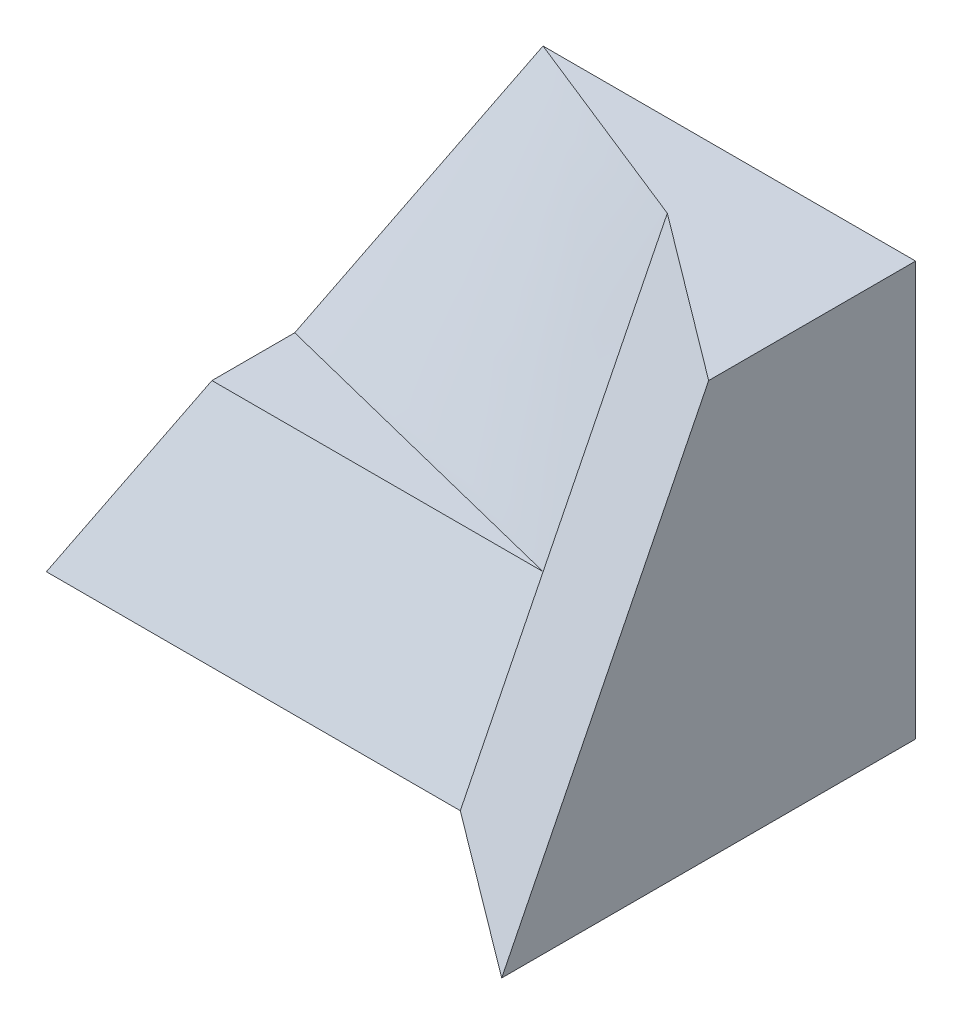
ISO-10303-21;
HEADER;
FILE_DESCRIPTION(('STEP AP214'),'2;1');
FILE_NAME('part.step','',(''),(''),'','','');
FILE_SCHEMA(('AUTOMOTIVE_DESIGN { 1 0 10303 214 1 1 1 1 }'));
ENDSEC;
DATA;
#1=APPLICATION_CONTEXT('core data for automotive mechanical design processes');
#2=APPLICATION_PROTOCOL_DEFINITION('international standard','automotive_design',2000,#1);
#3=PRODUCT_CONTEXT('',#1,'mechanical');
#4=PRODUCT('Part','Part','',(#3));
#5=PRODUCT_RELATED_PRODUCT_CATEGORY('part','',(#4));
#6=PRODUCT_DEFINITION_FORMATION('','',#4);
#7=PRODUCT_DEFINITION_CONTEXT('part definition',#1,'design');
#8=PRODUCT_DEFINITION('design','',#6,#7);
#9=PRODUCT_DEFINITION_SHAPE('','',#8);
#10=(LENGTH_UNIT() NAMED_UNIT(*) SI_UNIT(.MILLI.,.METRE.));
#11=(NAMED_UNIT(*) PLANE_ANGLE_UNIT() SI_UNIT($,.RADIAN.));
#12=(NAMED_UNIT(*) SI_UNIT($,.STERADIAN.) SOLID_ANGLE_UNIT());
#13=UNCERTAINTY_MEASURE_WITH_UNIT(LENGTH_MEASURE(1.E-05),#10,'distance_accuracy_value','');
#14=(GEOMETRIC_REPRESENTATION_CONTEXT(3) GLOBAL_UNCERTAINTY_ASSIGNED_CONTEXT((#13)) GLOBAL_UNIT_ASSIGNED_CONTEXT((#10,
#11,#12)) REPRESENTATION_CONTEXT('',''));
#15=CARTESIAN_POINT('',(0.,0.,0.));
#16=DIRECTION('',(0.,0.,1.));
#17=DIRECTION('',(1.,0.,0.));
#18=AXIS2_PLACEMENT_3D('',#15,#16,#17);
#19=CARTESIAN_POINT('',(-3.5,2.5,1.));
#20=DIRECTION('',(0.,-0.447213595499958,-0.894427190999916));
#21=DIRECTION('',(0.,0.894427190999916,-0.447213595499958));
#22=AXIS2_PLACEMENT_3D('',#19,#20,#21);
#23=PLANE('',#22);
#24=DIRECTION('',(1.,0.,0.));
#25=VECTOR('',#24,1.);
#26=CARTESIAN_POINT('',(-3.5,-0.500000000000001,2.5));
#27=LINE('',#26,#25);
#28=CARTESIAN_POINT('',(-2.5,-0.500000000000001,2.5));
#29=VERTEX_POINT('',#28);
#30=CARTESIAN_POINT('',(1.49999999499081,-0.49949843516576,2.49974923855887));
#31=VERTEX_POINT('',#30);
#32=EDGE_CURVE('E12',#29,#31,#27,.T.);
#33=ORIENTED_EDGE('',*,*,#32,.F.);
#34=DIRECTION('',(-0.408248290463863,-0.816496580927726,0.408248290463863));
#35=VECTOR('',#34,1.);
#36=CARTESIAN_POINT('',(-2.33333333333334,-0.166666666666667,2.33333333333333));
#37=LINE('',#36,#35);
#38=CARTESIAN_POINT('',(-3.5,-2.5,3.5));
#39=VERTEX_POINT('',#38);
#40=EDGE_CURVE('E120',#29,#39,#37,.T.);
#41=ORIENTED_EDGE('',*,*,#40,.T.);
#42=DIRECTION('',(1.,0.,0.));
#43=VECTOR('',#42,1.);
#44=CARTESIAN_POINT('',(-3.5,-2.5,3.5));
#45=LINE('',#44,#43);
#46=CARTESIAN_POINT('',(1.5,-2.5,3.5));
#47=VERTEX_POINT('',#46);
#48=EDGE_CURVE('E115',#39,#47,#45,.T.);
#49=ORIENTED_EDGE('',*,*,#48,.T.);
#50=DIRECTION('',(0.,0.894427190999916,-0.447213595499958));
#51=VECTOR('',#50,1.);
#52=CARTESIAN_POINT('',(1.5,-2.5,3.5));
#53=LINE('',#52,#51);
#54=EDGE_CURVE('E180',#47,#31,#53,.T.);
#55=ORIENTED_EDGE('',*,*,#54,.T.);
#56=EDGE_LOOP('',(#33,#41,#49,#55));
#57=FACE_BOUND('',#56,.T.);
#58=ADVANCED_FACE('F36',(#57),#23,.F.);
#59=CARTESIAN_POINT('',(0.,-2.5,5.));
#60=DIRECTION('',(0.,-1.,0.));
#61=DIRECTION('',(1.,0.,0.));
#62=AXIS2_PLACEMENT_3D('',#59,#60,#61);
#63=PLANE('',#62);
#64=ORIENTED_EDGE('',*,*,#48,.F.);
#65=DIRECTION('',(0.,0.,-1.));
#66=VECTOR('',#65,1.);
#67=CARTESIAN_POINT('',(-3.5,-2.5,5.));
#68=LINE('',#67,#66);
#69=CARTESIAN_POINT('',(-3.5,-2.5,0.));
#70=VERTEX_POINT('',#69);
#71=EDGE_CURVE('E62',#39,#70,#68,.T.);
#72=ORIENTED_EDGE('',*,*,#71,.T.);
#73=DIRECTION('',(-1.,0.,0.));
#74=VECTOR('',#73,1.);
#75=CARTESIAN_POINT('',(0.,-2.5,0.));
#76=LINE('',#75,#74);
#77=CARTESIAN_POINT('',(3.5,-2.5,0.));
#78=VERTEX_POINT('',#77);
#79=EDGE_CURVE('E183',#78,#70,#76,.T.);
#80=ORIENTED_EDGE('',*,*,#79,.F.);
#81=DIRECTION('',(0.,0.,-1.));
#82=VECTOR('',#81,1.);
#83=CARTESIAN_POINT('',(3.5,-2.5,5.));
#84=LINE('',#83,#82);
#85=CARTESIAN_POINT('',(3.5,-2.5,5.));
#86=VERTEX_POINT('',#85);
#87=EDGE_CURVE('E47',#86,#78,#84,.T.);
#88=ORIENTED_EDGE('',*,*,#87,.F.);
#89=DIRECTION('',(-0.8,0.,-0.6));
#90=VECTOR('',#89,1.);
#91=CARTESIAN_POINT('',(3.5,-2.5,5.));
#92=LINE('',#91,#90);
#93=EDGE_CURVE('E174',#86,#47,#92,.T.);
#94=ORIENTED_EDGE('',*,*,#93,.T.);
#95=EDGE_LOOP('',(#64,#72,#80,#88,#94));
#96=FACE_BOUND('',#95,.T.);
#97=ADVANCED_FACE('F38',(#96),#63,.T.);
#98=CARTESIAN_POINT('',(3.5,0.,5.));
#99=DIRECTION('',(1.,0.,0.));
#100=DIRECTION('',(0.,1.,0.));
#101=AXIS2_PLACEMENT_3D('',#98,#99,#100);
#102=PLANE('',#101);
#103=DIRECTION('',(0.,0.,-1.));
#104=VECTOR('',#103,1.);
#105=CARTESIAN_POINT('',(3.5,2.5,5.));
#106=LINE('',#105,#104);
#107=CARTESIAN_POINT('',(3.5,2.5,2.5));
#108=VERTEX_POINT('',#107);
#109=CARTESIAN_POINT('',(3.5,2.5,0.));
#110=VERTEX_POINT('',#109);
#111=EDGE_CURVE('E201',#108,#110,#106,.T.);
#112=ORIENTED_EDGE('',*,*,#111,.F.);
#113=DIRECTION('',(0.,-0.894427190999916,0.447213595499958));
#114=VECTOR('',#113,1.);
#115=CARTESIAN_POINT('',(3.5,2.5,2.5));
#116=LINE('',#115,#114);
#117=EDGE_CURVE('E177',#108,#86,#116,.T.);
#118=ORIENTED_EDGE('',*,*,#117,.T.);
#119=ORIENTED_EDGE('',*,*,#87,.T.);
#120=DIRECTION('',(0.,-1.,0.));
#121=VECTOR('',#120,1.);
#122=CARTESIAN_POINT('',(3.5,0.,0.));
#123=LINE('',#122,#121);
#124=EDGE_CURVE('E196',#110,#78,#123,.T.);
#125=ORIENTED_EDGE('',*,*,#124,.F.);
#126=EDGE_LOOP('',(#112,#118,#119,#125));
#127=FACE_BOUND('',#126,.T.);
#128=ADVANCED_FACE('F239',(#127),#102,.T.);
#129=CARTESIAN_POINT('',(0.,2.5,5.));
#130=DIRECTION('',(0.,-1.,0.));
#131=DIRECTION('',(1.,0.,0.));
#132=AXIS2_PLACEMENT_3D('',#129,#130,#131);
#133=PLANE('',#132);
#134=DIRECTION('',(-1.,0.,0.));
#135=VECTOR('',#134,1.);
#136=CARTESIAN_POINT('',(0.,2.5,0.));
#137=LINE('',#136,#135);
#138=CARTESIAN_POINT('',(-1.00006375654728,2.50011954352615,0.000762430436338035));
#139=VERTEX_POINT('',#138);
#140=EDGE_CURVE('E199',#110,#139,#137,.T.);
#141=ORIENTED_EDGE('',*,*,#140,.T.);
#142=CARTESIAN_POINT('',(1.50021741228457,2.49959235196642,0.999293410075138));
#143=CARTESIAN_POINT('',(1.39588324561377,2.49988497110604,0.958129375331939));
#144=CARTESIAN_POINT('',(1.29161180404469,2.50008307623686,0.916806443358955));
#145=CARTESIAN_POINT('',(1.08314635242492,2.50033409658177,0.833908915649146));
#146=CARTESIAN_POINT('',(0.978952360359691,2.50038698481392,0.792334274581646));
#147=CARTESIAN_POINT('',(0.770618639280685,2.50039133358123,0.709009251750408));
#148=CARTESIAN_POINT('',(0.666478919361713,2.50034278058262,0.667258847278852));
#149=CARTESIAN_POINT('',(0.458228935684702,2.5001906695274,0.583662744287227));
#150=CARTESIAN_POINT('',(0.354118674646693,2.50008710743751,0.541817039003707));
#151=CARTESIAN_POINT('',(0.145900995845282,2.49987487584203,0.458116823310599));
#152=CARTESIAN_POINT('',(0.0417935781019091,2.49976620630677,0.416262312851274));
#153=CARTESIAN_POINT('',(-0.166447704056789,2.49959862650725,0.332639577978069));
#154=CARTESIAN_POINT('',(-0.270581566178799,2.49953971284328,0.290871347863409));
#155=CARTESIAN_POINT('',(-0.478907918440386,2.49953186287807,0.207525525693154));
#156=CARTESIAN_POINT('',(-0.583100397675124,2.49958291036673,0.165947906443845));
#157=CARTESIAN_POINT('',(-0.791581114386241,2.49986454004039,0.0831038588574716));
#158=CARTESIAN_POINT('',(-0.895869324555028,2.50009508121571,0.0418373616112312));
#159=CARTESIAN_POINT('',(-1.00024008118109,2.50045015221454,0.000780263838536825));
#160=B_SPLINE_CURVE_WITH_KNOTS('',3,(#142,#143,#144,#145,#146,#147,#148,#149,#150,#151,#152,
#153,#154,#155,#156,#157,#158,#159),.UNSPECIFIED.,.F.,.F.,(4,2,2,2,2,2,2,2,4),(0.,
0.336483664304154,0.673029844543172,1.00962092791999,1.34623669367658,1.68285441482449,
2.01944913374451,2.35599423642809,2.69246246975392),.UNSPECIFIED.);
#161=CARTESIAN_POINT('',(1.50020412974058,2.4998907316807,0.999405016011522));
#162=VERTEX_POINT('',#161);
#163=EDGE_CURVE('E105',#139,#162,#160,.F.);
#164=ORIENTED_EDGE('',*,*,#163,.T.);
#165=DIRECTION('',(0.8,0.,0.6));
#166=VECTOR('',#165,1.);
#167=CARTESIAN_POINT('',(1.5,2.5,1.));
#168=LINE('',#167,#166);
#169=EDGE_CURVE('E186',#162,#108,#168,.T.);
#170=ORIENTED_EDGE('',*,*,#169,.T.);
#171=ORIENTED_EDGE('',*,*,#111,.T.);
#172=EDGE_LOOP('',(#141,#164,#170,#171));
#173=FACE_BOUND('',#172,.T.);
#174=ADVANCED_FACE('F236',(#173),#133,.F.);
#175=CARTESIAN_POINT('',(-1.8,0.9,5.));
#176=DIRECTION('',(-0.894427190999916,0.447213595499958,0.));
#177=DIRECTION('',(-0.447213595499958,-0.894427190999916,0.));
#178=AXIS2_PLACEMENT_3D('',#175,#176,#177);
#179=PLANE('',#178);
#180=CARTESIAN_POINT('',(-1.00024008118109,2.50045015221454,0.000780263838536738));
#181=CARTESIAN_POINT('',(-1.06257985554123,2.37512753926243,0.0627466460640722));
#182=CARTESIAN_POINT('',(-1.12499615433921,2.24997446405537,0.124976861087853));
#183=CARTESIAN_POINT('',(-1.24992048781638,1.99984031634894,0.249735431547686));
#184=CARTESIAN_POINT('',(-1.31242853256175,1.87485926617812,0.31226382170463));
#185=CARTESIAN_POINT('',(-1.43746211946966,1.62492796408178,0.437376301868997));
#186=CARTESIAN_POINT('',(-1.49998766212768,1.49997771326859,0.499960393593188));
#187=CARTESIAN_POINT('',(-1.6250227483665,1.25004563029584,0.62507566083486));
#188=CARTESIAN_POINT('',(-1.68753229218433,1.12506379866605,0.68760683717223));
#189=CARTESIAN_POINT('',(-1.81252975322941,0.875058500959137,0.812598273665645));
#190=CARTESIAN_POINT('',(-1.87501767095135,0.750035035983145,0.87505853553023));
#191=CARTESIAN_POINT('',(-1.99998679151774,0.499975101551016,0.999956995471192));
#192=CARTESIAN_POINT('',(-2.06246799440794,0.374938632196623,1.06239519370552));
#193=CARTESIAN_POINT('',(-2.1874461858687,0.124896500292413,1.18732359543439));
#194=CARTESIAN_POINT('',(-2.24994317468042,-0.00010916172089409,1.24981379976167));
#195=CARTESIAN_POINT('',(-2.37495340306852,-0.25009001567908,1.37484702333442));
#196=CARTESIAN_POINT('',(-2.4374666429684,-0.375065206903113,1.43739004369764));
#197=CARTESIAN_POINT('',(-2.49998739347421,-0.500023637235856,1.49995902879118));
#198=B_SPLINE_CURVE_WITH_KNOTS('',3,(#180,#181,#182,#183,#184,#185,#186,#187,#188,#189,#190,
#191,#192,#193,#194,#195,#196,#197),.UNSPECIFIED.,.F.,.F.,(4,2,2,2,2,2,2,2,4),(0.,
0.45922238573829,0.918499619009477,1.37779153495631,1.83707619918852,2.29634955253612,
2.75561954859536,3.21489704572823,3.67418451917144),.UNSPECIFIED.);
#199=CARTESIAN_POINT('',(-2.49999684836856,-0.500005909308965,1.49997951439559));
#200=VERTEX_POINT('',#199);
#201=EDGE_CURVE('E98',#200,#139,#198,.F.);
#202=ORIENTED_EDGE('',*,*,#201,.T.);
#203=DIRECTION('',(0.447213595499958,0.894427190999916,0.));
#204=VECTOR('',#203,1.);
#205=CARTESIAN_POINT('',(-1.8,0.9,0.));
#206=LINE('',#205,#204);
#207=EDGE_CURVE('E202',#70,#139,#206,.T.);
#208=ORIENTED_EDGE('',*,*,#207,.F.);
#209=ORIENTED_EDGE('',*,*,#71,.F.);
#210=ORIENTED_EDGE('',*,*,#40,.F.);
#211=DIRECTION('',(0.,0.,1.));
#212=VECTOR('',#211,1.);
#213=CARTESIAN_POINT('',(-2.5,-0.500000000000001,1.5));
#214=LINE('',#213,#212);
#215=EDGE_CURVE('E54',#200,#29,#214,.T.);
#216=ORIENTED_EDGE('',*,*,#215,.F.);
#217=EDGE_LOOP('',(#202,#208,#209,#210,#216));
#218=FACE_BOUND('',#217,.T.);
#219=ADVANCED_FACE('F119',(#218),#179,.T.);
#220=CARTESIAN_POINT('',(0.,0.,0.));
#221=DIRECTION('',(0.,0.,1.));
#222=DIRECTION('',(1.,0.,0.));
#223=AXIS2_PLACEMENT_3D('',#220,#221,#222);
#224=PLANE('',#223);
#225=ORIENTED_EDGE('',*,*,#79,.T.);
#226=ORIENTED_EDGE('',*,*,#207,.T.);
#227=ORIENTED_EDGE('',*,*,#140,.F.);
#228=ORIENTED_EDGE('',*,*,#124,.T.);
#229=EDGE_LOOP('',(#225,#226,#227,#228));
#230=FACE_BOUND('',#229,.T.);
#231=ADVANCED_FACE('F235',(#230),#224,.F.);
#232=CARTESIAN_POINT('',(-0.46551724137931,0.310344827586206,0.620689655172413));
#233=DIRECTION('',(-0.557086014531156,0.371390676354104,0.742781352708207));
#234=DIRECTION('',(0.8,0.,0.6));
#235=AXIS2_PLACEMENT_3D('',#232,#233,#234);
#236=PLANE('',#235);
#237=ORIENTED_EDGE('',*,*,#54,.F.);
#238=ORIENTED_EDGE('',*,*,#93,.F.);
#239=ORIENTED_EDGE('',*,*,#117,.F.);
#240=ORIENTED_EDGE('',*,*,#169,.F.);
#241=CARTESIAN_POINT('',(1.5,2.17718730413038,1.16140634793481));
#242=CARTESIAN_POINT('',(1.50000468228797,2.19062896544598,1.15466591019613));
#243=CARTESIAN_POINT('',(1.50000980322136,2.20406989026768,1.14792400387669));
#244=CARTESIAN_POINT('',(1.50002100134446,2.2309499469332,1.13443708340345));
#245=CARTESIAN_POINT('',(1.50002707852091,2.24438907879928,1.12769206929404));
#246=CARTESIAN_POINT('',(1.50004026812243,2.27126540138688,1.11419867654388));
#247=CARTESIAN_POINT('',(1.50004738053203,2.28470259213441,1.10745029795492));
#248=CARTESIAN_POINT('',(1.50006272275998,2.31157487845855,1.09394990921329));
#249=CARTESIAN_POINT('',(1.5000709525604,2.32500997406533,1.08719789912065));
#250=CARTESIAN_POINT('',(1.5000886139544,2.35187791189003,1.07368997312093));
#251=CARTESIAN_POINT('',(1.50009804552734,2.36531075414268,1.06693405728291));
#252=CARTESIAN_POINT('',(1.50011819729235,2.39217402247012,1.0534180376032));
#253=CARTESIAN_POINT('',(1.50012891746083,2.40560444858464,1.04665793384042));
#254=CARTESIAN_POINT('',(1.50015173535602,2.4324627178807,1.03313324925632));
#255=CARTESIAN_POINT('',(1.50016383305593,2.4458905611074,1.0263686685246));
#256=CARTESIAN_POINT('',(1.50018949773614,2.4727434926659,1.01283473189694));
#257=CARTESIAN_POINT('',(1.50020306468619,2.48616858104876,1.0060653761022));
#258=CARTESIAN_POINT('',(1.50021741228457,2.49959235196642,0.999293410075137));
#259=B_SPLINE_CURVE_WITH_KNOTS('',3,(#241,#242,#243,#244,#245,#246,#247,#248,#249,#250,#251,
#252,#253,#254,#255,#256,#257,#258),.UNSPECIFIED.,.F.,.F.,(4,2,2,2,2,2,2,2,4),(0.,
0.0451110411991693,0.0902214570225914,0.13533119855842,0.180440216033226,0.225548458945161,
0.270655876204701,0.315762416282728,0.360868027365716),.UNSPECIFIED.);
#260=CARTESIAN_POINT('',(1.5,2.17718730413038,1.16140634793481));
#261=VERTEX_POINT('',#260);
#262=EDGE_CURVE('E122',#261,#162,#259,.T.);
#263=ORIENTED_EDGE('',*,*,#262,.F.);
#264=CARTESIAN_POINT('',(1.49996412490112,-0.499932733739104,2.50011659384611));
#265=CARTESIAN_POINT('',(1.49996564150141,-0.388386043820741,2.44433689812321));
#266=CARTESIAN_POINT('',(1.49996607922978,-0.276837544981492,2.38856081571605));
#267=CARTESIAN_POINT('',(1.49996936035429,-0.0537450579260563,2.27700083247942));
#268=CARTESIAN_POINT('',(1.49997220374008,0.0577989303074912,2.22121693168467));
#269=CARTESIAN_POINT('',(1.49998485947247,0.280874294341047,2.10962625378848));
#270=CARTESIAN_POINT('',(1.4999946717607,0.392405670238894,2.05381947688261));
#271=CARTESIAN_POINT('',(1.50001214211144,0.615472408756108,1.94221295053026));
#272=CARTESIAN_POINT('',(1.50001980016669,0.727007771387655,1.88641320110812));
#273=CARTESIAN_POINT('',(1.50002542926202,0.950096442161453,1.77484529388454));
#274=CARTESIAN_POINT('',(1.50002340015324,1.06164975055313,1.71907713658173));
#275=CARTESIAN_POINT('',(1.50000876190008,1.28477585975458,1.60757537966612));
#276=CARTESIAN_POINT('',(1.49999615258653,1.39634866084752,1.55184178062015));
#277=CARTESIAN_POINT('',(1.49996962224223,1.61949616591045,1.44037912390543));
#278=CARTESIAN_POINT('',(1.49995570121503,1.73107086987447,1.38465006622481));
#279=CARTESIAN_POINT('',(1.49995269219622,1.9541737161971,1.27311124332975));
#280=CARTESIAN_POINT('',(1.49996360310077,2.06570186040497,1.21730148181302));
#281=CARTESIAN_POINT('',(1.5,2.17718730413038,1.16140634793481));
#282=B_SPLINE_CURVE_WITH_KNOTS('',3,(#264,#265,#266,#267,#268,#269,#270,#271,#272,#273,#274,
#275,#276,#277,#278,#279,#280,#281),.UNSPECIFIED.,.F.,.F.,(4,2,2,2,2,2,2,2,4),(0.,
0.374147496387179,0.748293381105003,1.12243613121907,1.49658014361081,1.87072990539766,
2.24488564983013,2.61904038177286,2.99317848194229),.UNSPECIFIED.);
#283=EDGE_CURVE('E169',#31,#261,#282,.T.);
#284=ORIENTED_EDGE('',*,*,#283,.F.);
#285=EDGE_LOOP('',(#237,#238,#239,#240,#263,#284));
#286=FACE_BOUND('',#285,.T.);
#287=ADVANCED_FACE('F254',(#286),#236,.T.);
#288=CARTESIAN_POINT('',(1.5,-0.5,2.5));
#289=DIRECTION('',(0.,1.,0.));
#290=DIRECTION('',(-1.,0.,0.));
#291=AXIS2_PLACEMENT_3D('',#288,#289,#290);
#292=PLANE('',#291);
#293=ORIENTED_EDGE('',*,*,#32,.T.);
#294=CARTESIAN_POINT('',(-2.49998739347421,-0.500023637235856,1.49995902879119));
#295=CARTESIAN_POINT('',(-2.33330700803136,-0.500051023875809,1.54157800342398));
#296=CARTESIAN_POINT('',(-2.166630975705,-0.500068487568892,1.58321441261182));
#297=CARTESIAN_POINT('',(-1.83328777494686,-0.500086795127805,1.66651603869139));
#298=CARTESIAN_POINT('',(-1.66662060644643,-0.50008763915,1.70818125530839));
#299=CARTESIAN_POINT('',(-1.33329334466946,-0.500075933869332,1.79153492060988));
#300=CARTESIAN_POINT('',(-1.1666332513509,-0.500063384662101,1.83322336912636));
#301=CARTESIAN_POINT('',(-0.83331613302684,-0.500032515994254,1.91661027022068));
#302=CARTESIAN_POINT('',(-0.666659108013262,-0.500014196552036,1.95830872276622));
#303=CARTESIAN_POINT('',(-0.333343774636343,-0.499980032364242,2.041701329261));
#304=CARTESIAN_POINT('',(-0.166685466271727,-0.499964187621566,2.08339548320515));
#305=CARTESIAN_POINT('',(0.166635542042605,-0.499940868449406,2.1667692644051));
#306=CARTESIAN_POINT('',(0.33329824200805,-0.499933394055706,2.20844889159803));
#307=CARTESIAN_POINT('',(0.666628585845516,-0.499928042356515,2.29179146739589));
#308=CARTESIAN_POINT('',(0.833296229735961,-0.499930165092968,2.33345441592712));
#309=CARTESIAN_POINT('',(1.16663136774891,-0.499934129750845,2.41678079973565));
#310=CARTESIAN_POINT('',(1.33329886187144,-0.499935971672313,2.45844423501288));
#311=CARTESIAN_POINT('',(1.4999641249011,-0.499932734189564,2.50011659407142));
#312=B_SPLINE_CURVE_WITH_KNOTS('',3,(#294,#295,#296,#297,#298,#299,#300,#301,#302,#303,#304,
#305,#306,#307,#308,#309,#310,#311),.UNSPECIFIED.,.F.,.F.,(4,2,2,2,2,2,2,2,4),(0.,
0.515393454482963,1.03078205989002,1.54616698525336,2.06155026738439,2.57693415332313,
3.09232024263409,3.60770858449852,4.12309684462697),.UNSPECIFIED.);
#313=EDGE_CURVE('E101',#31,#200,#312,.F.);
#314=ORIENTED_EDGE('',*,*,#313,.T.);
#315=ORIENTED_EDGE('',*,*,#215,.T.);
#316=EDGE_LOOP('',(#293,#314,#315));
#317=FACE_BOUND('',#316,.T.);
#318=ADVANCED_FACE('F114',(#317),#292,.T.);
#319=CARTESIAN_POINT('',(-2.5463773549551,-0.528159471307533,1.50599970421025));
#320=CARTESIAN_POINT('',(-1.74123016555744,-0.577283672322582,1.73708580799251));
#321=CARTESIAN_POINT('',(-0.935596403515254,-0.627320197046121,1.96659055068006));
#322=CARTESIAN_POINT('',(-0.129491567482945,-0.678239985501137,2.19456430289971));
#323=CARTESIAN_POINT('',(0.677816923326439,-0.731416626663173,2.41862617709387));
#324=CARTESIAN_POINT('',(1.48593930965574,-0.786119321925055,2.64004289084828));
#325=CARTESIAN_POINT('',(-2.40506345792811,0.0947372343674046,1.15133973718164));
#326=CARTESIAN_POINT('',(-1.60292949911258,0.0512628406938515,1.39221884035582));
#327=CARTESIAN_POINT('',(-0.800195543948773,0.00666345386726847,1.6311479553981));
#328=CARTESIAN_POINT('',(0.00241250146750618,-0.0376998521826908,1.87048627711984));
#329=CARTESIAN_POINT('',(0.806008533627891,-0.0839156333778512,2.10661364192324));
#330=CARTESIAN_POINT('',(1.6101164494614,-0.131091196460119,2.34107738478899));
#331=CARTESIAN_POINT('',(-2.26208817589592,0.714518843157592,0.791280268886124));
#332=CARTESIAN_POINT('',(-1.46307052112065,0.676887519559513,1.04228736019113));
#333=CARTESIAN_POINT('',(-0.664952568730221,0.64094313793303,1.2962184842469));
#334=CARTESIAN_POINT('',(0.134036780895099,0.603364886491107,1.54731756728926));
#335=CARTESIAN_POINT('',(0.932508675575962,0.566756863070055,1.80009837890111));
#336=CARTESIAN_POINT('',(1.73185419696073,0.528510789579167,2.05003990372526));
#337=CARTESIAN_POINT('',(-2.11879678353448,1.33370774508043,0.430193442020533));
#338=CARTESIAN_POINT('',(-1.32315253741825,1.30240156271806,0.69216411146744));
#339=CARTESIAN_POINT('',(-0.528399830870454,1.27276701704649,0.957032284511742));
#340=CARTESIAN_POINT('',(0.263701570041448,1.24810366944225,1.23051720087272));
#341=CARTESIAN_POINT('',(1.0581808696516,1.21898176177877,1.49627394646437));
#342=CARTESIAN_POINT('',(1.85391814131109,1.1875011565228,1.7579422828957));
#343=CARTESIAN_POINT('',(-1.9693888413748,1.94142811613156,0.0492278283106594));
#344=CARTESIAN_POINT('',(-1.17885996098627,1.91971324450863,0.327823436372599));
#345=CARTESIAN_POINT('',(-0.39123392571985,1.90344120748966,0.615853291081379));
#346=CARTESIAN_POINT('',(0.393787093953391,1.89205357470789,0.912349446467999));
#347=CARTESIAN_POINT('',(1.18141471011351,1.87577857351324,1.20037416327228));
#348=CARTESIAN_POINT('',(1.97082697799996,1.85615735033169,1.48259876196594));
#349=CARTESIAN_POINT('',(-1.81701547728017,2.54358832105467,-0.341375406687786));
#350=CARTESIAN_POINT('',(-1.03215102644237,2.53249425483936,-0.0443704025859831));
#351=CARTESIAN_POINT('',(-0.253723492545755,2.53346940788877,0.27355458157467));
#352=CARTESIAN_POINT('',(0.524298323501399,2.53520528190591,0.592798148746075));
#353=CARTESIAN_POINT('',(1.30332254030274,2.53506165450897,0.90878391346637));
#354=CARTESIAN_POINT('',(2.08583305550108,2.52838121761764,1.21343920839642));
#355=B_SPLINE_SURFACE_WITH_KNOTS('',5,5,((#319,#320,#321,#322,#323,#324),(#325,#326,#327,#328,
#329,#330),(#331,#332,#333,#334,#335,#336),(#337,#338,#339,#340,#341,#342),(#343,#344,#345,#346,
#347,#348),(#349,#350,#351,#352,#353,#354)),.UNSPECIFIED.,.F.,.F.,.F.,(6,6),(6,6),
(-1.89296982758788,1.75634600035851),(-2.16114610725743,2.03008850306223),.UNSPECIFIED.);
#356=ORIENTED_EDGE('',*,*,#163,.F.);
#357=ORIENTED_EDGE('',*,*,#201,.F.);
#358=ORIENTED_EDGE('',*,*,#313,.F.);
#359=ORIENTED_EDGE('',*,*,#283,.T.);
#360=ORIENTED_EDGE('',*,*,#262,.T.);
#361=EDGE_LOOP('',(#356,#357,#358,#359,#360));
#362=FACE_BOUND('',#361,.T.);
#363=ADVANCED_FACE('F100',(#362),#355,.F.);
#364=CLOSED_SHELL('',(#58,#97,#128,#174,#219,#231,#287,#318,#363));
#365=MANIFOLD_SOLID_BREP('B2',#364);
#366=ADVANCED_BREP_SHAPE_REPRESENTATION('',(#18,#365),#14);
#367=SHAPE_DEFINITION_REPRESENTATION(#9,#366);
ENDSEC;
END-ISO-10303-21;
